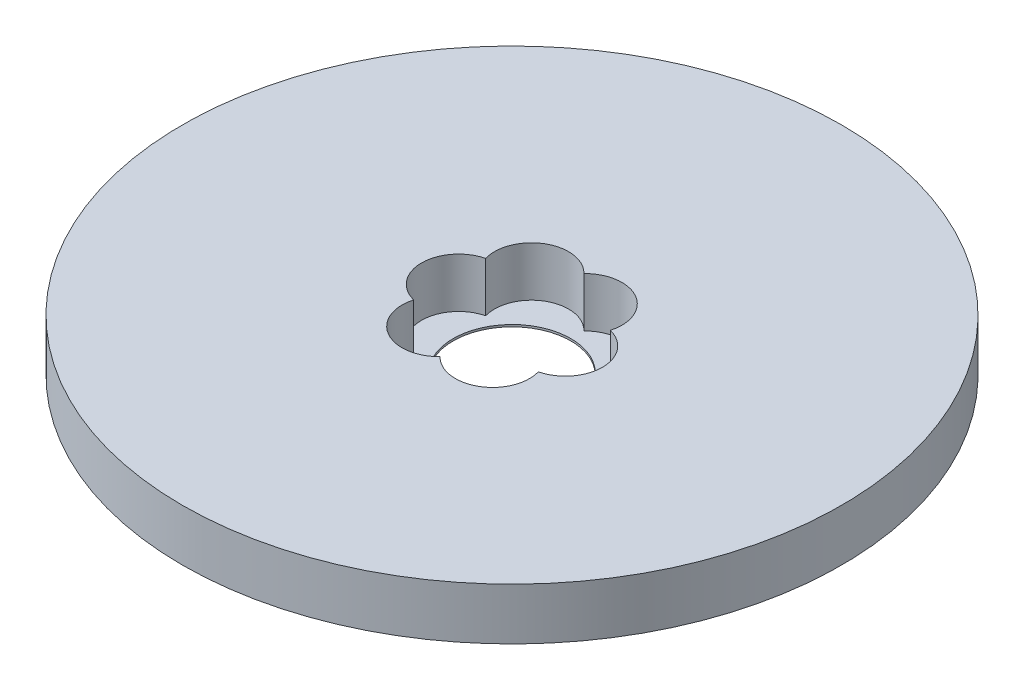
ISO-10303-21;
HEADER;
FILE_DESCRIPTION(('STEP AP214'),'2;1');
FILE_NAME('part.step','',(''),(''),'','','');
FILE_SCHEMA(('AUTOMOTIVE_DESIGN { 1 0 10303 214 1 1 1 1 }'));
ENDSEC;
DATA;
#1=APPLICATION_CONTEXT('core data for automotive mechanical design processes');
#2=APPLICATION_PROTOCOL_DEFINITION('international standard','automotive_design',2000,#1);
#3=PRODUCT_CONTEXT('',#1,'mechanical');
#4=PRODUCT('Part','Part','',(#3));
#5=PRODUCT_RELATED_PRODUCT_CATEGORY('part','',(#4));
#6=PRODUCT_DEFINITION_FORMATION('','',#4);
#7=PRODUCT_DEFINITION_CONTEXT('part definition',#1,'design');
#8=PRODUCT_DEFINITION('design','',#6,#7);
#9=PRODUCT_DEFINITION_SHAPE('','',#8);
#10=(LENGTH_UNIT() NAMED_UNIT(*) SI_UNIT(.MILLI.,.METRE.));
#11=(NAMED_UNIT(*) PLANE_ANGLE_UNIT() SI_UNIT($,.RADIAN.));
#12=(NAMED_UNIT(*) SI_UNIT($,.STERADIAN.) SOLID_ANGLE_UNIT());
#13=UNCERTAINTY_MEASURE_WITH_UNIT(LENGTH_MEASURE(1.E-05),#10,'distance_accuracy_value','');
#14=(GEOMETRIC_REPRESENTATION_CONTEXT(3) GLOBAL_UNCERTAINTY_ASSIGNED_CONTEXT((#13)) GLOBAL_UNIT_ASSIGNED_CONTEXT((#10,
#11,#12)) REPRESENTATION_CONTEXT('',''));
#15=CARTESIAN_POINT('',(0.,0.,0.));
#16=DIRECTION('',(0.,0.,1.));
#17=DIRECTION('',(1.,0.,0.));
#18=AXIS2_PLACEMENT_3D('',#15,#16,#17);
#19=CARTESIAN_POINT('',(0.,11.,0.));
#20=DIRECTION('',(0.,-1.,0.));
#21=DIRECTION('',(0.,0.,-1.));
#22=AXIS2_PLACEMENT_3D('',#19,#20,#21);
#23=CYLINDRICAL_SURFACE('',#22,12.5);
#24=CARTESIAN_POINT('',(0.,0.,0.));
#25=DIRECTION('',(0.,1.,0.));
#26=DIRECTION('',(0.,0.,1.));
#27=AXIS2_PLACEMENT_3D('',#24,#25,#26);
#28=CIRCLE('',#27,12.5);
#29=CARTESIAN_POINT('',(0.,0.,12.5));
#30=VERTEX_POINT('',#29);
#31=EDGE_CURVE('E142',#30,#30,#28,.T.);
#32=ORIENTED_EDGE('',*,*,#31,.F.);
#33=EDGE_LOOP('',(#32));
#34=FACE_BOUND('',#33,.T.);
#35=CARTESIAN_POINT('',(0.,0.437678763067113,0.));
#36=DIRECTION('',(0.,1.,0.));
#37=DIRECTION('',(0.,0.,1.));
#38=AXIS2_PLACEMENT_3D('',#35,#36,#37);
#39=CIRCLE('',#38,12.5);
#40=CARTESIAN_POINT('',(0.,0.437678763067113,12.5));
#41=VERTEX_POINT('',#40);
#42=EDGE_CURVE('E11',#41,#41,#39,.T.);
#43=ORIENTED_EDGE('',*,*,#42,.T.);
#44=EDGE_LOOP('',(#43));
#45=FACE_BOUND('',#44,.T.);
#46=ADVANCED_FACE('F39',(#34,#45),#23,.F.);
#47=CARTESIAN_POINT('',(0.,11.,0.));
#48=DIRECTION('',(0.,-1.,0.));
#49=DIRECTION('',(0.,0.,-1.));
#50=AXIS2_PLACEMENT_3D('',#47,#48,#49);
#51=CYLINDRICAL_SURFACE('',#50,70.);
#52=CARTESIAN_POINT('',(0.,11.,0.));
#53=DIRECTION('',(0.,1.,0.));
#54=DIRECTION('',(0.,0.,1.));
#55=AXIS2_PLACEMENT_3D('',#52,#53,#54);
#56=CIRCLE('',#55,70.);
#57=CARTESIAN_POINT('',(0.,11.,70.));
#58=VERTEX_POINT('',#57);
#59=EDGE_CURVE('E50',#58,#58,#56,.T.);
#60=ORIENTED_EDGE('',*,*,#59,.F.);
#61=EDGE_LOOP('',(#60));
#62=FACE_BOUND('',#61,.T.);
#63=CARTESIAN_POINT('',(0.,0.,0.));
#64=DIRECTION('',(0.,1.,0.));
#65=DIRECTION('',(0.,0.,1.));
#66=AXIS2_PLACEMENT_3D('',#63,#64,#65);
#67=CIRCLE('',#66,70.);
#68=CARTESIAN_POINT('',(0.,0.,70.));
#69=VERTEX_POINT('',#68);
#70=EDGE_CURVE('E150',#69,#69,#67,.T.);
#71=ORIENTED_EDGE('',*,*,#70,.T.);
#72=EDGE_LOOP('',(#71));
#73=FACE_BOUND('',#72,.T.);
#74=ADVANCED_FACE('F41',(#62,#73),#51,.T.);
#75=CARTESIAN_POINT('',(0.,11.,0.));
#76=DIRECTION('',(0.,1.,0.));
#77=DIRECTION('',(0.,0.,1.));
#78=AXIS2_PLACEMENT_3D('',#75,#76,#77);
#79=PLANE('',#78);
#80=CARTESIAN_POINT('',(-5.66715464609341,11.,9.81579978138385));
#81=DIRECTION('',(0.,1.,0.));
#82=DIRECTION('',(0.86602540378444,0.,0.499999999999998));
#83=AXIS2_PLACEMENT_3D('',#80,#81,#82);
#84=CIRCLE('',#83,7.87459016100206);
#85=CARTESIAN_POINT('',(-13.2356444620759,11.,7.64160289307771));
#86=VERTEX_POINT('',#85);
#87=CARTESIAN_POINT('',(0.,11.,15.2832057861554));
#88=VERTEX_POINT('',#87);
#89=EDGE_CURVE('E132',#86,#88,#84,.T.);
#90=ORIENTED_EDGE('',*,*,#89,.F.);
#91=CARTESIAN_POINT('',(-11.3343092921869,11.,0.));
#92=DIRECTION('',(0.,1.,0.));
#93=DIRECTION('',(0.,0.,1.));
#94=AXIS2_PLACEMENT_3D('',#91,#92,#93);
#95=CIRCLE('',#94,7.87459016100206);
#96=CARTESIAN_POINT('',(-13.235644462076,11.,-7.64160289307767));
#97=VERTEX_POINT('',#96);
#98=EDGE_CURVE('E138',#97,#86,#95,.T.);
#99=ORIENTED_EDGE('',*,*,#98,.F.);
#100=CARTESIAN_POINT('',(-5.66715464609354,11.,-9.81579978138378));
#101=DIRECTION('',(0.,1.,0.));
#102=DIRECTION('',(-0.866025403784433,0.,0.50000000000001));
#103=AXIS2_PLACEMENT_3D('',#100,#101,#102);
#104=CIRCLE('',#103,7.87459016100206);
#105=CARTESIAN_POINT('',(-1.59594559789866E-13,11.,-15.2832057861554));
#106=VERTEX_POINT('',#105);
#107=EDGE_CURVE('E53',#106,#97,#104,.T.);
#108=ORIENTED_EDGE('',*,*,#107,.F.);
#109=CARTESIAN_POINT('',(5.66715464609334,11.,-9.81579978138389));
#110=DIRECTION('',(0.,1.,0.));
#111=DIRECTION('',(-0.866025403784443,0.,-0.499999999999992));
#112=AXIS2_PLACEMENT_3D('',#109,#110,#111);
#113=CIRCLE('',#112,7.87459016100206);
#114=CARTESIAN_POINT('',(13.2356444620758,11.,-7.64160289307772));
#115=VERTEX_POINT('',#114);
#116=EDGE_CURVE('E106',#115,#106,#113,.T.);
#117=ORIENTED_EDGE('',*,*,#116,.F.);
#118=CARTESIAN_POINT('',(11.3343092921869,11.,0.));
#119=DIRECTION('',(0.,1.,0.));
#120=DIRECTION('',(0.,0.,-1.));
#121=AXIS2_PLACEMENT_3D('',#118,#119,#120);
#122=CIRCLE('',#121,7.87459016100206);
#123=CARTESIAN_POINT('',(13.2356444620759,11.,7.64160289307769));
#124=VERTEX_POINT('',#123);
#125=EDGE_CURVE('E104',#124,#115,#122,.T.);
#126=ORIENTED_EDGE('',*,*,#125,.F.);
#127=CARTESIAN_POINT('',(5.66715464609348,11.,9.81579978138382));
#128=DIRECTION('',(0.,1.,0.));
#129=DIRECTION('',(0.866025403784436,0.,-0.500000000000004));
#130=AXIS2_PLACEMENT_3D('',#127,#128,#129);
#131=CIRCLE('',#130,7.87459016100206);
#132=EDGE_CURVE('E123',#88,#124,#131,.T.);
#133=ORIENTED_EDGE('',*,*,#132,.F.);
#134=EDGE_LOOP('',(#90,#99,#108,#117,#126,#133));
#135=FACE_BOUND('',#134,.T.);
#136=ORIENTED_EDGE('',*,*,#59,.T.);
#137=EDGE_LOOP('',(#136));
#138=FACE_BOUND('',#137,.T.);
#139=ADVANCED_FACE('F156',(#135,#138),#79,.T.);
#140=CARTESIAN_POINT('',(0.,0.,0.));
#141=DIRECTION('',(0.,1.,0.));
#142=DIRECTION('',(0.,0.,1.));
#143=AXIS2_PLACEMENT_3D('',#140,#141,#142);
#144=PLANE('',#143);
#145=ORIENTED_EDGE('',*,*,#31,.T.);
#146=EDGE_LOOP('',(#145));
#147=FACE_BOUND('',#146,.T.);
#148=ORIENTED_EDGE('',*,*,#70,.F.);
#149=EDGE_LOOP('',(#148));
#150=FACE_BOUND('',#149,.T.);
#151=ADVANCED_FACE('F153',(#147,#150),#144,.F.);
#152=CARTESIAN_POINT('',(-11.3343092921869,0.437678763067113,0.));
#153=DIRECTION('',(0.,1.,0.));
#154=DIRECTION('',(0.,0.,1.));
#155=AXIS2_PLACEMENT_3D('',#152,#153,#154);
#156=CYLINDRICAL_SURFACE('',#155,7.87459016100206);
#157=ORIENTED_EDGE('',*,*,#98,.T.);
#158=DIRECTION('',(0.,1.,0.));
#159=VECTOR('',#158,1.);
#160=CARTESIAN_POINT('',(-13.2356444620759,5.71883938153356,7.64160289307771));
#161=LINE('',#160,#159);
#162=CARTESIAN_POINT('',(-13.2356444620759,0.437678763067113,7.64160289307771));
#163=VERTEX_POINT('',#162);
#164=EDGE_CURVE('E65',#86,#163,#161,.F.);
#165=ORIENTED_EDGE('',*,*,#164,.T.);
#166=CARTESIAN_POINT('',(-11.3343092921869,0.437678763067113,0.));
#167=DIRECTION('',(0.,1.,0.));
#168=DIRECTION('',(0.,0.,1.));
#169=AXIS2_PLACEMENT_3D('',#166,#167,#168);
#170=CIRCLE('',#169,7.87459016100206);
#171=CARTESIAN_POINT('',(-13.235644462076,0.437678763067113,-7.64160289307767));
#172=VERTEX_POINT('',#171);
#173=EDGE_CURVE('E139',#172,#163,#170,.T.);
#174=ORIENTED_EDGE('',*,*,#173,.F.);
#175=DIRECTION('',(0.,1.,0.));
#176=VECTOR('',#175,1.);
#177=CARTESIAN_POINT('',(-13.235644462076,5.71883938153356,-7.64160289307767));
#178=LINE('',#177,#176);
#179=EDGE_CURVE('E114',#172,#97,#178,.T.);
#180=ORIENTED_EDGE('',*,*,#179,.T.);
#181=EDGE_LOOP('',(#157,#165,#174,#180));
#182=FACE_BOUND('',#181,.T.);
#183=ADVANCED_FACE('F154',(#182),#156,.F.);
#184=CARTESIAN_POINT('',(-11.3343092921869,0.437678763067113,0.));
#185=DIRECTION('',(0.,1.,0.));
#186=DIRECTION('',(0.,0.,1.));
#187=AXIS2_PLACEMENT_3D('',#184,#185,#186);
#188=PLANE('',#187);
#189=CARTESIAN_POINT('',(-5.66715464609354,0.437678763067113,-9.81579978138378));
#190=DIRECTION('',(0.,1.,0.));
#191=DIRECTION('',(-0.866025403784433,0.,0.50000000000001));
#192=AXIS2_PLACEMENT_3D('',#189,#190,#191);
#193=CIRCLE('',#192,7.87459016100206);
#194=CARTESIAN_POINT('',(-1.60461921527855E-13,0.437678763067113,-15.2832057861554));
#195=VERTEX_POINT('',#194);
#196=EDGE_CURVE('E97',#195,#172,#193,.T.);
#197=ORIENTED_EDGE('',*,*,#196,.T.);
#198=ORIENTED_EDGE('',*,*,#173,.T.);
#199=CARTESIAN_POINT('',(-5.66715464609341,0.437678763067113,9.81579978138385));
#200=DIRECTION('',(0.,1.,0.));
#201=DIRECTION('',(0.86602540378444,0.,0.499999999999998));
#202=AXIS2_PLACEMENT_3D('',#199,#200,#201);
#203=CIRCLE('',#202,7.87459016100206);
#204=CARTESIAN_POINT('',(0.,0.437678763067113,15.2832057861554));
#205=VERTEX_POINT('',#204);
#206=EDGE_CURVE('E133',#163,#205,#203,.T.);
#207=ORIENTED_EDGE('',*,*,#206,.T.);
#208=CARTESIAN_POINT('',(5.66715464609348,0.437678763067113,9.81579978138382));
#209=DIRECTION('',(0.,1.,0.));
#210=DIRECTION('',(0.866025403784436,0.,-0.500000000000004));
#211=AXIS2_PLACEMENT_3D('',#208,#209,#210);
#212=CIRCLE('',#211,7.87459016100206);
#213=CARTESIAN_POINT('',(13.2356444620759,0.437678763067113,7.64160289307769));
#214=VERTEX_POINT('',#213);
#215=EDGE_CURVE('E124',#205,#214,#212,.T.);
#216=ORIENTED_EDGE('',*,*,#215,.T.);
#217=CARTESIAN_POINT('',(11.3343092921869,0.437678763067113,0.));
#218=DIRECTION('',(0.,1.,0.));
#219=DIRECTION('',(0.,0.,-1.));
#220=AXIS2_PLACEMENT_3D('',#217,#218,#219);
#221=CIRCLE('',#220,7.87459016100206);
#222=CARTESIAN_POINT('',(13.2356444620758,0.437678763067113,-7.64160289307773));
#223=VERTEX_POINT('',#222);
#224=EDGE_CURVE('E105',#214,#223,#221,.T.);
#225=ORIENTED_EDGE('',*,*,#224,.T.);
#226=CARTESIAN_POINT('',(5.66715464609334,0.437678763067113,-9.81579978138389));
#227=DIRECTION('',(0.,1.,0.));
#228=DIRECTION('',(-0.866025403784443,0.,-0.499999999999992));
#229=AXIS2_PLACEMENT_3D('',#226,#227,#228);
#230=CIRCLE('',#229,7.87459016100206);
#231=EDGE_CURVE('E91',#223,#195,#230,.T.);
#232=ORIENTED_EDGE('',*,*,#231,.T.);
#233=EDGE_LOOP('',(#197,#198,#207,#216,#225,#232));
#234=FACE_BOUND('',#233,.T.);
#235=ORIENTED_EDGE('',*,*,#42,.F.);
#236=EDGE_LOOP('',(#235));
#237=FACE_BOUND('',#236,.T.);
#238=ADVANCED_FACE('F92',(#234,#237),#188,.T.);
#239=CARTESIAN_POINT('',(-5.66715464609341,0.437678763067113,9.81579978138385));
#240=DIRECTION('',(0.,1.,0.));
#241=DIRECTION('',(0.,0.,1.));
#242=AXIS2_PLACEMENT_3D('',#239,#240,#241);
#243=CYLINDRICAL_SURFACE('',#242,7.87459016100206);
#244=ORIENTED_EDGE('',*,*,#89,.T.);
#245=DIRECTION('',(0.,1.,0.));
#246=VECTOR('',#245,1.);
#247=CARTESIAN_POINT('',(0.,5.71883938153356,15.2832057861554));
#248=LINE('',#247,#246);
#249=EDGE_CURVE('E128',#88,#205,#248,.F.);
#250=ORIENTED_EDGE('',*,*,#249,.T.);
#251=ORIENTED_EDGE('',*,*,#206,.F.);
#252=ORIENTED_EDGE('',*,*,#164,.F.);
#253=EDGE_LOOP('',(#244,#250,#251,#252));
#254=FACE_BOUND('',#253,.T.);
#255=ADVANCED_FACE('F177',(#254),#243,.F.);
#256=CARTESIAN_POINT('',(-5.66715464609354,0.437678763067113,-9.81579978138378));
#257=DIRECTION('',(0.,1.,0.));
#258=DIRECTION('',(0.,0.,1.));
#259=AXIS2_PLACEMENT_3D('',#256,#257,#258);
#260=CYLINDRICAL_SURFACE('',#259,7.87459016100206);
#261=ORIENTED_EDGE('',*,*,#196,.F.);
#262=DIRECTION('',(0.,1.,0.));
#263=VECTOR('',#262,1.);
#264=CARTESIAN_POINT('',(-1.60461921527855E-13,5.71883938153356,-15.2832057861554));
#265=LINE('',#264,#263);
#266=EDGE_CURVE('E107',#106,#195,#265,.F.);
#267=ORIENTED_EDGE('',*,*,#266,.F.);
#268=ORIENTED_EDGE('',*,*,#107,.T.);
#269=ORIENTED_EDGE('',*,*,#179,.F.);
#270=EDGE_LOOP('',(#261,#267,#268,#269));
#271=FACE_BOUND('',#270,.T.);
#272=ADVANCED_FACE('F115',(#271),#260,.F.);
#273=CARTESIAN_POINT('',(5.66715464609348,0.437678763067113,9.81579978138382));
#274=DIRECTION('',(0.,1.,0.));
#275=DIRECTION('',(0.,0.,1.));
#276=AXIS2_PLACEMENT_3D('',#273,#274,#275);
#277=CYLINDRICAL_SURFACE('',#276,7.87459016100206);
#278=ORIENTED_EDGE('',*,*,#132,.T.);
#279=DIRECTION('',(0.,1.,0.));
#280=VECTOR('',#279,1.);
#281=CARTESIAN_POINT('',(13.2356444620759,5.71883938153356,7.64160289307769));
#282=LINE('',#281,#280);
#283=EDGE_CURVE('E118',#124,#214,#282,.F.);
#284=ORIENTED_EDGE('',*,*,#283,.T.);
#285=ORIENTED_EDGE('',*,*,#215,.F.);
#286=ORIENTED_EDGE('',*,*,#249,.F.);
#287=EDGE_LOOP('',(#278,#284,#285,#286));
#288=FACE_BOUND('',#287,.T.);
#289=ADVANCED_FACE('F182',(#288),#277,.F.);
#290=CARTESIAN_POINT('',(11.3343092921869,0.437678763067113,0.));
#291=DIRECTION('',(0.,1.,0.));
#292=DIRECTION('',(0.,0.,1.));
#293=AXIS2_PLACEMENT_3D('',#290,#291,#292);
#294=CYLINDRICAL_SURFACE('',#293,7.87459016100206);
#295=DIRECTION('',(0.,1.,0.));
#296=VECTOR('',#295,1.);
#297=CARTESIAN_POINT('',(13.2356444620758,5.71883938153356,-7.64160289307772));
#298=LINE('',#297,#296);
#299=EDGE_CURVE('E130',#115,#223,#298,.F.);
#300=ORIENTED_EDGE('',*,*,#299,.T.);
#301=ORIENTED_EDGE('',*,*,#224,.F.);
#302=ORIENTED_EDGE('',*,*,#283,.F.);
#303=ORIENTED_EDGE('',*,*,#125,.T.);
#304=EDGE_LOOP('',(#300,#301,#302,#303));
#305=FACE_BOUND('',#304,.T.);
#306=ADVANCED_FACE('F184',(#305),#294,.F.);
#307=CARTESIAN_POINT('',(5.66715464609334,0.437678763067113,-9.81579978138389));
#308=DIRECTION('',(0.,1.,0.));
#309=DIRECTION('',(0.,0.,1.));
#310=AXIS2_PLACEMENT_3D('',#307,#308,#309);
#311=CYLINDRICAL_SURFACE('',#310,7.87459016100206);
#312=ORIENTED_EDGE('',*,*,#116,.T.);
#313=ORIENTED_EDGE('',*,*,#266,.T.);
#314=ORIENTED_EDGE('',*,*,#231,.F.);
#315=ORIENTED_EDGE('',*,*,#299,.F.);
#316=EDGE_LOOP('',(#312,#313,#314,#315));
#317=FACE_BOUND('',#316,.T.);
#318=ADVANCED_FACE('F108',(#317),#311,.F.);
#319=CLOSED_SHELL('',(#46,#74,#139,#151,#183,#238,#255,#272,#289,#306,#318));
#320=MANIFOLD_SOLID_BREP('B2',#319);
#321=ADVANCED_BREP_SHAPE_REPRESENTATION('',(#18,#320),#14);
#322=SHAPE_DEFINITION_REPRESENTATION(#9,#321);
ENDSEC;
END-ISO-10303-21;
